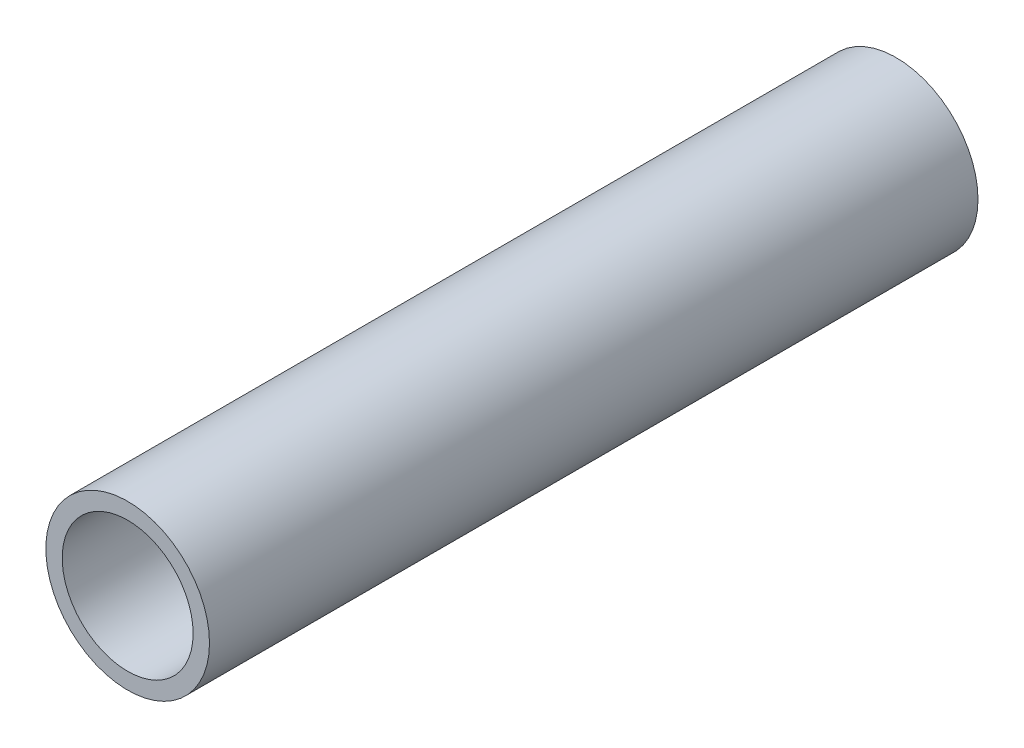
ISO-10303-21;
HEADER;
FILE_DESCRIPTION(('STEP AP214'),'2;1');
FILE_NAME('part.step','',(''),(''),'','','');
FILE_SCHEMA(('AUTOMOTIVE_DESIGN { 1 0 10303 214 1 1 1 1 }'));
ENDSEC;
DATA;
#1=APPLICATION_CONTEXT('core data for automotive mechanical design processes');
#2=APPLICATION_PROTOCOL_DEFINITION('international standard','automotive_design',2000,#1);
#3=PRODUCT_CONTEXT('',#1,'mechanical');
#4=PRODUCT('Part','Part','',(#3));
#5=PRODUCT_RELATED_PRODUCT_CATEGORY('part','',(#4));
#6=PRODUCT_DEFINITION_FORMATION('','',#4);
#7=PRODUCT_DEFINITION_CONTEXT('part definition',#1,'design');
#8=PRODUCT_DEFINITION('design','',#6,#7);
#9=PRODUCT_DEFINITION_SHAPE('','',#8);
#10=(LENGTH_UNIT() NAMED_UNIT(*) SI_UNIT(.MILLI.,.METRE.));
#11=(NAMED_UNIT(*) PLANE_ANGLE_UNIT() SI_UNIT($,.RADIAN.));
#12=(NAMED_UNIT(*) SI_UNIT($,.STERADIAN.) SOLID_ANGLE_UNIT());
#13=UNCERTAINTY_MEASURE_WITH_UNIT(LENGTH_MEASURE(1.E-05),#10,'distance_accuracy_value','');
#14=(GEOMETRIC_REPRESENTATION_CONTEXT(3) GLOBAL_UNCERTAINTY_ASSIGNED_CONTEXT((#13)) GLOBAL_UNIT_ASSIGNED_CONTEXT((#10,
#11,#12)) REPRESENTATION_CONTEXT('',''));
#15=CARTESIAN_POINT('',(0.,0.,0.));
#16=DIRECTION('',(0.,0.,1.));
#17=DIRECTION('',(1.,0.,0.));
#18=AXIS2_PLACEMENT_3D('',#15,#16,#17);
#19=CARTESIAN_POINT('',(0.,0.,11.74));
#20=DIRECTION('',(0.,0.,1.));
#21=DIRECTION('',(1.,0.,0.));
#22=AXIS2_PLACEMENT_3D('',#19,#20,#21);
#23=PLANE('',#22);
#24=CARTESIAN_POINT('',(0.,0.,11.74));
#25=DIRECTION('',(0.,0.,1.));
#26=DIRECTION('',(1.,0.,0.));
#27=AXIS2_PLACEMENT_3D('',#24,#25,#26);
#28=CIRCLE('',#27,1.25);
#29=CARTESIAN_POINT('',(1.25,0.,11.74));
#30=VERTEX_POINT('',#29);
#31=EDGE_CURVE('E10',#30,#30,#28,.T.);
#32=ORIENTED_EDGE('',*,*,#31,.T.);
#33=EDGE_LOOP('',(#32));
#34=FACE_BOUND('',#33,.T.);
#35=CARTESIAN_POINT('',(0.,0.,11.74));
#36=DIRECTION('',(0.,0.,1.));
#37=DIRECTION('',(1.,0.,0.));
#38=AXIS2_PLACEMENT_3D('',#35,#36,#37);
#39=CIRCLE('',#38,1.);
#40=CARTESIAN_POINT('',(1.,0.,11.74));
#41=VERTEX_POINT('',#40);
#42=EDGE_CURVE('E42',#41,#41,#39,.T.);
#43=ORIENTED_EDGE('',*,*,#42,.F.);
#44=EDGE_LOOP('',(#43));
#45=FACE_BOUND('',#44,.T.);
#46=ADVANCED_FACE('F31',(#34,#45),#23,.T.);
#47=CARTESIAN_POINT('',(0.,0.,0.));
#48=DIRECTION('',(0.,0.,1.));
#49=DIRECTION('',(1.,0.,0.));
#50=AXIS2_PLACEMENT_3D('',#47,#48,#49);
#51=PLANE('',#50);
#52=CARTESIAN_POINT('',(0.,0.,0.));
#53=DIRECTION('',(0.,0.,1.));
#54=DIRECTION('',(1.,0.,0.));
#55=AXIS2_PLACEMENT_3D('',#52,#53,#54);
#56=CIRCLE('',#55,1.25);
#57=CARTESIAN_POINT('',(1.25,0.,0.));
#58=VERTEX_POINT('',#57);
#59=EDGE_CURVE('E35',#58,#58,#56,.T.);
#60=ORIENTED_EDGE('',*,*,#59,.F.);
#61=EDGE_LOOP('',(#60));
#62=FACE_BOUND('',#61,.T.);
#63=CARTESIAN_POINT('',(0.,0.,0.));
#64=DIRECTION('',(0.,0.,1.));
#65=DIRECTION('',(1.,0.,0.));
#66=AXIS2_PLACEMENT_3D('',#63,#64,#65);
#67=CIRCLE('',#66,1.);
#68=CARTESIAN_POINT('',(1.,0.,0.));
#69=VERTEX_POINT('',#68);
#70=EDGE_CURVE('E44',#69,#69,#67,.T.);
#71=ORIENTED_EDGE('',*,*,#70,.T.);
#72=EDGE_LOOP('',(#71));
#73=FACE_BOUND('',#72,.T.);
#74=ADVANCED_FACE('F54',(#62,#73),#51,.F.);
#75=CARTESIAN_POINT('',(0.,0.,11.74));
#76=DIRECTION('',(0.,0.,-1.));
#77=DIRECTION('',(-1.,0.,0.));
#78=AXIS2_PLACEMENT_3D('',#75,#76,#77);
#79=CYLINDRICAL_SURFACE('',#78,1.25);
#80=ORIENTED_EDGE('',*,*,#31,.F.);
#81=EDGE_LOOP('',(#80));
#82=FACE_BOUND('',#81,.T.);
#83=ORIENTED_EDGE('',*,*,#59,.T.);
#84=EDGE_LOOP('',(#83));
#85=FACE_BOUND('',#84,.T.);
#86=ADVANCED_FACE('F33',(#82,#85),#79,.T.);
#87=CARTESIAN_POINT('',(0.,0.,11.74));
#88=DIRECTION('',(0.,0.,-1.));
#89=DIRECTION('',(-1.,0.,0.));
#90=AXIS2_PLACEMENT_3D('',#87,#88,#89);
#91=CYLINDRICAL_SURFACE('',#90,1.);
#92=ORIENTED_EDGE('',*,*,#42,.T.);
#93=EDGE_LOOP('',(#92));
#94=FACE_BOUND('',#93,.T.);
#95=ORIENTED_EDGE('',*,*,#70,.F.);
#96=EDGE_LOOP('',(#95));
#97=FACE_BOUND('',#96,.T.);
#98=ADVANCED_FACE('F50',(#94,#97),#91,.F.);
#99=CLOSED_SHELL('',(#46,#74,#86,#98));
#100=MANIFOLD_SOLID_BREP('B2',#99);
#101=ADVANCED_BREP_SHAPE_REPRESENTATION('',(#18,#100),#14);
#102=SHAPE_DEFINITION_REPRESENTATION(#9,#101);
ENDSEC;
END-ISO-10303-21;
